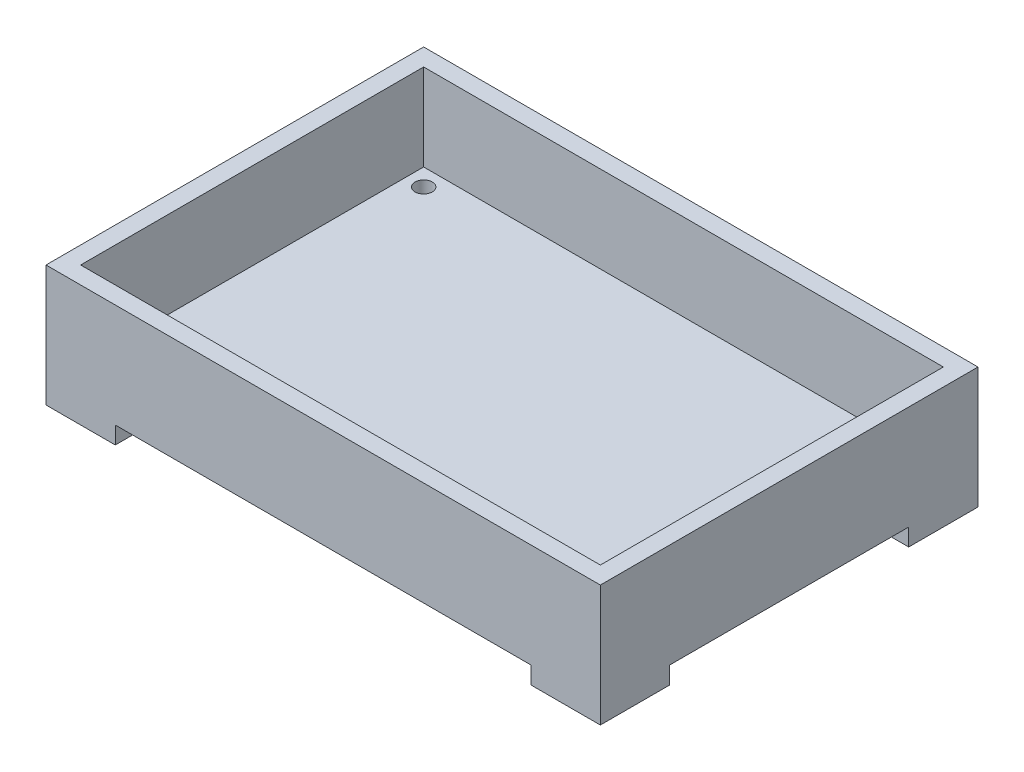
ISO-10303-21;
HEADER;
FILE_DESCRIPTION(('STEP AP214'),'2;1');
FILE_NAME('part.step','',(''),(''),'','','');
FILE_SCHEMA(('AUTOMOTIVE_DESIGN { 1 0 10303 214 1 1 1 1 }'));
ENDSEC;
DATA;
#1=APPLICATION_CONTEXT('core data for automotive mechanical design processes');
#2=APPLICATION_PROTOCOL_DEFINITION('international standard','automotive_design',2000,#1);
#3=PRODUCT_CONTEXT('',#1,'mechanical');
#4=PRODUCT('Part','Part','',(#3));
#5=PRODUCT_RELATED_PRODUCT_CATEGORY('part','',(#4));
#6=PRODUCT_DEFINITION_FORMATION('','',#4);
#7=PRODUCT_DEFINITION_CONTEXT('part definition',#1,'design');
#8=PRODUCT_DEFINITION('design','',#6,#7);
#9=PRODUCT_DEFINITION_SHAPE('','',#8);
#10=(LENGTH_UNIT() NAMED_UNIT(*) SI_UNIT(.MILLI.,.METRE.));
#11=(NAMED_UNIT(*) PLANE_ANGLE_UNIT() SI_UNIT($,.RADIAN.));
#12=(NAMED_UNIT(*) SI_UNIT($,.STERADIAN.) SOLID_ANGLE_UNIT());
#13=UNCERTAINTY_MEASURE_WITH_UNIT(LENGTH_MEASURE(1.E-05),#10,'distance_accuracy_value','');
#14=(GEOMETRIC_REPRESENTATION_CONTEXT(3) GLOBAL_UNCERTAINTY_ASSIGNED_CONTEXT((#13)) GLOBAL_UNIT_ASSIGNED_CONTEXT((#10,
#11,#12)) REPRESENTATION_CONTEXT('',''));
#15=CARTESIAN_POINT('',(0.,0.,0.));
#16=DIRECTION('',(0.,0.,1.));
#17=DIRECTION('',(1.,0.,0.));
#18=AXIS2_PLACEMENT_3D('',#15,#16,#17);
#19=CARTESIAN_POINT('',(0.,0.,0.));
#20=DIRECTION('',(0.,-1.,0.));
#21=DIRECTION('',(0.,0.,-1.));
#22=AXIS2_PLACEMENT_3D('',#19,#20,#21);
#23=PLANE('',#22);
#24=DIRECTION('',(0.,0.,-1.));
#25=VECTOR('',#24,1.);
#26=CARTESIAN_POINT('',(-76.2,0.,-69.215));
#27=LINE('',#26,#25);
#28=CARTESIAN_POINT('',(-76.2,0.,-43.815));
#29=VERTEX_POINT('',#28);
#30=CARTESIAN_POINT('',(-76.2,0.,-69.215));
#31=VERTEX_POINT('',#30);
#32=EDGE_CURVE('E210',#29,#31,#27,.T.);
#33=ORIENTED_EDGE('',*,*,#32,.T.);
#34=DIRECTION('',(-1.,0.,0.));
#35=VECTOR('',#34,1.);
#36=CARTESIAN_POINT('',(-101.6,0.,-69.215));
#37=LINE('',#36,#35);
#38=CARTESIAN_POINT('',(76.2,0.,-69.215));
#39=VERTEX_POINT('',#38);
#40=EDGE_CURVE('E405',#39,#31,#37,.T.);
#41=ORIENTED_EDGE('',*,*,#40,.F.);
#42=DIRECTION('',(0.,0.,-1.));
#43=VECTOR('',#42,1.);
#44=CARTESIAN_POINT('',(76.2,0.,-69.215));
#45=LINE('',#44,#43);
#46=CARTESIAN_POINT('',(76.2,0.,-43.815));
#47=VERTEX_POINT('',#46);
#48=EDGE_CURVE('E238',#47,#39,#45,.T.);
#49=ORIENTED_EDGE('',*,*,#48,.F.);
#50=DIRECTION('',(-1.,0.,0.));
#51=VECTOR('',#50,1.);
#52=CARTESIAN_POINT('',(101.6,0.,-43.815));
#53=LINE('',#52,#51);
#54=CARTESIAN_POINT('',(101.6,0.,-43.815));
#55=VERTEX_POINT('',#54);
#56=EDGE_CURVE('E229',#55,#47,#53,.T.);
#57=ORIENTED_EDGE('',*,*,#56,.F.);
#58=DIRECTION('',(0.,0.,-1.));
#59=VECTOR('',#58,1.);
#60=CARTESIAN_POINT('',(101.6,0.,69.215));
#61=LINE('',#60,#59);
#62=CARTESIAN_POINT('',(101.6,0.,43.815));
#63=VERTEX_POINT('',#62);
#64=EDGE_CURVE('E354',#63,#55,#61,.T.);
#65=ORIENTED_EDGE('',*,*,#64,.F.);
#66=DIRECTION('',(-1.,0.,0.));
#67=VECTOR('',#66,1.);
#68=CARTESIAN_POINT('',(101.6,0.,43.815));
#69=LINE('',#68,#67);
#70=CARTESIAN_POINT('',(76.2,0.,43.815));
#71=VERTEX_POINT('',#70);
#72=EDGE_CURVE('E275',#63,#71,#69,.T.);
#73=ORIENTED_EDGE('',*,*,#72,.T.);
#74=DIRECTION('',(0.,0.,1.));
#75=VECTOR('',#74,1.);
#76=CARTESIAN_POINT('',(76.2,0.,69.215));
#77=LINE('',#76,#75);
#78=CARTESIAN_POINT('',(76.2,0.,69.215));
#79=VERTEX_POINT('',#78);
#80=EDGE_CURVE('E266',#71,#79,#77,.T.);
#81=ORIENTED_EDGE('',*,*,#80,.T.);
#82=DIRECTION('',(1.,0.,0.));
#83=VECTOR('',#82,1.);
#84=CARTESIAN_POINT('',(-101.6,0.,69.215));
#85=LINE('',#84,#83);
#86=CARTESIAN_POINT('',(-76.2,0.,69.215));
#87=VERTEX_POINT('',#86);
#88=EDGE_CURVE('E393',#87,#79,#85,.T.);
#89=ORIENTED_EDGE('',*,*,#88,.F.);
#90=DIRECTION('',(0.,0.,1.));
#91=VECTOR('',#90,1.);
#92=CARTESIAN_POINT('',(-76.2,0.,69.215));
#93=LINE('',#92,#91);
#94=CARTESIAN_POINT('',(-76.2,0.,43.815));
#95=VERTEX_POINT('',#94);
#96=EDGE_CURVE('E317',#95,#87,#93,.T.);
#97=ORIENTED_EDGE('',*,*,#96,.F.);
#98=DIRECTION('',(1.,0.,0.));
#99=VECTOR('',#98,1.);
#100=CARTESIAN_POINT('',(-101.6,0.,43.815));
#101=LINE('',#100,#99);
#102=CARTESIAN_POINT('',(-101.6,0.,43.815));
#103=VERTEX_POINT('',#102);
#104=EDGE_CURVE('E308',#103,#95,#101,.T.);
#105=ORIENTED_EDGE('',*,*,#104,.F.);
#106=DIRECTION('',(0.,0.,1.));
#107=VECTOR('',#106,1.);
#108=CARTESIAN_POINT('',(-101.6,0.,69.215));
#109=LINE('',#108,#107);
#110=CARTESIAN_POINT('',(-101.6,0.,-43.815));
#111=VERTEX_POINT('',#110);
#112=EDGE_CURVE('E408',#111,#103,#109,.T.);
#113=ORIENTED_EDGE('',*,*,#112,.F.);
#114=DIRECTION('',(1.,0.,0.));
#115=VECTOR('',#114,1.);
#116=CARTESIAN_POINT('',(-101.6,0.,-43.815));
#117=LINE('',#116,#115);
#118=EDGE_CURVE('E55',#111,#29,#117,.T.);
#119=ORIENTED_EDGE('',*,*,#118,.T.);
#120=EDGE_LOOP('',(#33,#41,#49,#57,#65,#73,#81,#89,#97,#105,#113,#119));
#121=FACE_BOUND('',#120,.T.);
#122=ADVANCED_FACE('F39',(#121),#23,.T.);
#123=CARTESIAN_POINT('',(0.,38.1,0.));
#124=DIRECTION('',(0.,-1.,0.));
#125=DIRECTION('',(0.,0.,-1.));
#126=AXIS2_PLACEMENT_3D('',#123,#124,#125);
#127=PLANE('',#126);
#128=DIRECTION('',(0.,0.,-1.));
#129=VECTOR('',#128,1.);
#130=CARTESIAN_POINT('',(101.6,38.1,69.215));
#131=LINE('',#130,#129);
#132=CARTESIAN_POINT('',(101.6,38.1,69.215));
#133=VERTEX_POINT('',#132);
#134=CARTESIAN_POINT('',(101.6,38.1,-69.215));
#135=VERTEX_POINT('',#134);
#136=EDGE_CURVE('E388',#133,#135,#131,.T.);
#137=ORIENTED_EDGE('',*,*,#136,.T.);
#138=DIRECTION('',(-1.,0.,0.));
#139=VECTOR('',#138,1.);
#140=CARTESIAN_POINT('',(-101.6,38.1,-69.215));
#141=LINE('',#140,#139);
#142=CARTESIAN_POINT('',(-101.6,38.1,-69.215));
#143=VERTEX_POINT('',#142);
#144=EDGE_CURVE('E392',#135,#143,#141,.T.);
#145=ORIENTED_EDGE('',*,*,#144,.T.);
#146=DIRECTION('',(0.,0.,1.));
#147=VECTOR('',#146,1.);
#148=CARTESIAN_POINT('',(-101.6,38.1,69.215));
#149=LINE('',#148,#147);
#150=CARTESIAN_POINT('',(-101.6,38.1,69.215));
#151=VERTEX_POINT('',#150);
#152=EDGE_CURVE('E184',#143,#151,#149,.T.);
#153=ORIENTED_EDGE('',*,*,#152,.T.);
#154=DIRECTION('',(1.,0.,0.));
#155=VECTOR('',#154,1.);
#156=CARTESIAN_POINT('',(-101.6,38.1,69.215));
#157=LINE('',#156,#155);
#158=EDGE_CURVE('E398',#151,#133,#157,.T.);
#159=ORIENTED_EDGE('',*,*,#158,.T.);
#160=EDGE_LOOP('',(#137,#145,#153,#159));
#161=FACE_BOUND('',#160,.T.);
#162=DIRECTION('',(0.,0.,-1.));
#163=VECTOR('',#162,1.);
#164=CARTESIAN_POINT('',(95.25,38.1,0.));
#165=LINE('',#164,#163);
#166=CARTESIAN_POINT('',(95.25,38.1,62.865));
#167=VERTEX_POINT('',#166);
#168=CARTESIAN_POINT('',(95.25,38.1,-62.865));
#169=VERTEX_POINT('',#168);
#170=EDGE_CURVE('E376',#167,#169,#165,.T.);
#171=ORIENTED_EDGE('',*,*,#170,.F.);
#172=DIRECTION('',(1.,0.,0.));
#173=VECTOR('',#172,1.);
#174=CARTESIAN_POINT('',(0.,38.1,62.865));
#175=LINE('',#174,#173);
#176=CARTESIAN_POINT('',(-95.25,38.1,62.865));
#177=VERTEX_POINT('',#176);
#178=EDGE_CURVE('E361',#177,#167,#175,.T.);
#179=ORIENTED_EDGE('',*,*,#178,.F.);
#180=DIRECTION('',(0.,0.,1.));
#181=VECTOR('',#180,1.);
#182=CARTESIAN_POINT('',(-95.25,38.1,0.));
#183=LINE('',#182,#181);
#184=CARTESIAN_POINT('',(-95.25,38.1,-62.865));
#185=VERTEX_POINT('',#184);
#186=EDGE_CURVE('E382',#185,#177,#183,.T.);
#187=ORIENTED_EDGE('',*,*,#186,.F.);
#188=DIRECTION('',(-1.,0.,0.));
#189=VECTOR('',#188,1.);
#190=CARTESIAN_POINT('',(0.,38.1,-62.865));
#191=LINE('',#190,#189);
#192=EDGE_CURVE('E379',#169,#185,#191,.T.);
#193=ORIENTED_EDGE('',*,*,#192,.F.);
#194=EDGE_LOOP('',(#171,#179,#187,#193));
#195=FACE_BOUND('',#194,.T.);
#196=ADVANCED_FACE('F453',(#161,#195),#127,.F.);
#197=CARTESIAN_POINT('',(101.6,38.1,69.215));
#198=DIRECTION('',(-1.,0.,0.));
#199=DIRECTION('',(0.,0.,1.));
#200=AXIS2_PLACEMENT_3D('',#197,#198,#199);
#201=PLANE('',#200);
#202=DIRECTION('',(0.,-1.,0.));
#203=VECTOR('',#202,1.);
#204=CARTESIAN_POINT('',(101.6,38.1,69.215));
#205=LINE('',#204,#203);
#206=CARTESIAN_POINT('',(101.6,-6.35,69.215));
#207=VERTEX_POINT('',#206);
#208=EDGE_CURVE('E401',#133,#207,#205,.T.);
#209=ORIENTED_EDGE('',*,*,#208,.T.);
#210=DIRECTION('',(0.,0.,-1.));
#211=VECTOR('',#210,1.);
#212=CARTESIAN_POINT('',(101.6,-6.35,69.215));
#213=LINE('',#212,#211);
#214=CARTESIAN_POINT('',(101.6,-6.35,43.815));
#215=VERTEX_POINT('',#214);
#216=EDGE_CURVE('E270',#207,#215,#213,.T.);
#217=ORIENTED_EDGE('',*,*,#216,.T.);
#218=DIRECTION('',(0.,1.,0.));
#219=VECTOR('',#218,1.);
#220=CARTESIAN_POINT('',(101.6,-6.35,43.815));
#221=LINE('',#220,#219);
#222=EDGE_CURVE('E287',#215,#63,#221,.T.);
#223=ORIENTED_EDGE('',*,*,#222,.T.);
#224=ORIENTED_EDGE('',*,*,#64,.T.);
#225=DIRECTION('',(0.,1.,0.));
#226=VECTOR('',#225,1.);
#227=CARTESIAN_POINT('',(101.6,-6.35,-43.815));
#228=LINE('',#227,#226);
#229=CARTESIAN_POINT('',(101.6,-6.35,-43.815));
#230=VERTEX_POINT('',#229);
#231=EDGE_CURVE('E258',#230,#55,#228,.T.);
#232=ORIENTED_EDGE('',*,*,#231,.F.);
#233=DIRECTION('',(0.,0.,1.));
#234=VECTOR('',#233,1.);
#235=CARTESIAN_POINT('',(101.6,-6.35,-69.215));
#236=LINE('',#235,#234);
#237=CARTESIAN_POINT('',(101.6,-6.35,-69.215));
#238=VERTEX_POINT('',#237);
#239=EDGE_CURVE('E233',#238,#230,#236,.T.);
#240=ORIENTED_EDGE('',*,*,#239,.F.);
#241=DIRECTION('',(0.,-1.,0.));
#242=VECTOR('',#241,1.);
#243=CARTESIAN_POINT('',(101.6,38.1,-69.215));
#244=LINE('',#243,#242);
#245=EDGE_CURVE('E11',#135,#238,#244,.T.);
#246=ORIENTED_EDGE('',*,*,#245,.F.);
#247=ORIENTED_EDGE('',*,*,#136,.F.);
#248=EDGE_LOOP('',(#209,#217,#223,#224,#232,#240,#246,#247));
#249=FACE_BOUND('',#248,.T.);
#250=ADVANCED_FACE('F41',(#249),#201,.F.);
#251=CARTESIAN_POINT('',(-101.6,38.1,-69.215));
#252=DIRECTION('',(0.,0.,1.));
#253=DIRECTION('',(1.,0.,0.));
#254=AXIS2_PLACEMENT_3D('',#251,#252,#253);
#255=PLANE('',#254);
#256=ORIENTED_EDGE('',*,*,#245,.T.);
#257=DIRECTION('',(1.,0.,0.));
#258=VECTOR('',#257,1.);
#259=CARTESIAN_POINT('',(101.6,-6.35,-69.215));
#260=LINE('',#259,#258);
#261=CARTESIAN_POINT('',(76.2,-6.35,-69.215));
#262=VERTEX_POINT('',#261);
#263=EDGE_CURVE('E244',#262,#238,#260,.T.);
#264=ORIENTED_EDGE('',*,*,#263,.F.);
#265=DIRECTION('',(0.,1.,0.));
#266=VECTOR('',#265,1.);
#267=CARTESIAN_POINT('',(76.2,-6.35,-69.215));
#268=LINE('',#267,#266);
#269=EDGE_CURVE('E63',#262,#39,#268,.T.);
#270=ORIENTED_EDGE('',*,*,#269,.T.);
#271=ORIENTED_EDGE('',*,*,#40,.T.);
#272=DIRECTION('',(0.,1.,0.));
#273=VECTOR('',#272,1.);
#274=CARTESIAN_POINT('',(-76.2,-6.35,-69.215));
#275=LINE('',#274,#273);
#276=CARTESIAN_POINT('',(-76.2,-6.35,-69.215));
#277=VERTEX_POINT('',#276);
#278=EDGE_CURVE('E199',#277,#31,#275,.T.);
#279=ORIENTED_EDGE('',*,*,#278,.F.);
#280=DIRECTION('',(-1.,0.,0.));
#281=VECTOR('',#280,1.);
#282=CARTESIAN_POINT('',(-101.6,-6.35,-69.215));
#283=LINE('',#282,#281);
#284=CARTESIAN_POINT('',(-101.6,-6.35,-69.215));
#285=VERTEX_POINT('',#284);
#286=EDGE_CURVE('E192',#277,#285,#283,.T.);
#287=ORIENTED_EDGE('',*,*,#286,.T.);
#288=DIRECTION('',(0.,-1.,0.));
#289=VECTOR('',#288,1.);
#290=CARTESIAN_POINT('',(-101.6,38.1,-69.215));
#291=LINE('',#290,#289);
#292=EDGE_CURVE('E48',#143,#285,#291,.T.);
#293=ORIENTED_EDGE('',*,*,#292,.F.);
#294=ORIENTED_EDGE('',*,*,#144,.F.);
#295=EDGE_LOOP('',(#256,#264,#270,#271,#279,#287,#293,#294));
#296=FACE_BOUND('',#295,.T.);
#297=ADVANCED_FACE('F198',(#296),#255,.F.);
#298=CARTESIAN_POINT('',(-101.6,38.1,69.215));
#299=DIRECTION('',(1.,0.,0.));
#300=DIRECTION('',(0.,0.,-1.));
#301=AXIS2_PLACEMENT_3D('',#298,#299,#300);
#302=PLANE('',#301);
#303=ORIENTED_EDGE('',*,*,#292,.T.);
#304=DIRECTION('',(0.,0.,1.));
#305=VECTOR('',#304,1.);
#306=CARTESIAN_POINT('',(-101.6,-6.35,-69.215));
#307=LINE('',#306,#305);
#308=CARTESIAN_POINT('',(-101.6,-6.35,-43.815));
#309=VERTEX_POINT('',#308);
#310=EDGE_CURVE('E181',#285,#309,#307,.T.);
#311=ORIENTED_EDGE('',*,*,#310,.T.);
#312=DIRECTION('',(0.,1.,0.));
#313=VECTOR('',#312,1.);
#314=CARTESIAN_POINT('',(-101.6,-6.35,-43.815));
#315=LINE('',#314,#313);
#316=EDGE_CURVE('E209',#309,#111,#315,.T.);
#317=ORIENTED_EDGE('',*,*,#316,.T.);
#318=ORIENTED_EDGE('',*,*,#112,.T.);
#319=DIRECTION('',(0.,1.,0.));
#320=VECTOR('',#319,1.);
#321=CARTESIAN_POINT('',(-101.6,-6.35,43.815));
#322=LINE('',#321,#320);
#323=CARTESIAN_POINT('',(-101.6,-6.35,43.815));
#324=VERTEX_POINT('',#323);
#325=EDGE_CURVE('E341',#324,#103,#322,.T.);
#326=ORIENTED_EDGE('',*,*,#325,.F.);
#327=DIRECTION('',(0.,0.,-1.));
#328=VECTOR('',#327,1.);
#329=CARTESIAN_POINT('',(-101.6,-6.35,69.215));
#330=LINE('',#329,#328);
#331=CARTESIAN_POINT('',(-101.6,-6.35,69.215));
#332=VERTEX_POINT('',#331);
#333=EDGE_CURVE('E312',#332,#324,#330,.T.);
#334=ORIENTED_EDGE('',*,*,#333,.F.);
#335=DIRECTION('',(0.,-1.,0.));
#336=VECTOR('',#335,1.);
#337=CARTESIAN_POINT('',(-101.6,38.1,69.215));
#338=LINE('',#337,#336);
#339=EDGE_CURVE('E187',#151,#332,#338,.T.);
#340=ORIENTED_EDGE('',*,*,#339,.F.);
#341=ORIENTED_EDGE('',*,*,#152,.F.);
#342=EDGE_LOOP('',(#303,#311,#317,#318,#326,#334,#340,#341));
#343=FACE_BOUND('',#342,.T.);
#344=ADVANCED_FACE('F180',(#343),#302,.F.);
#345=CARTESIAN_POINT('',(-101.6,38.1,69.215));
#346=DIRECTION('',(0.,0.,-1.));
#347=DIRECTION('',(-1.,0.,0.));
#348=AXIS2_PLACEMENT_3D('',#345,#346,#347);
#349=PLANE('',#348);
#350=ORIENTED_EDGE('',*,*,#339,.T.);
#351=DIRECTION('',(-1.,0.,0.));
#352=VECTOR('',#351,1.);
#353=CARTESIAN_POINT('',(-101.6,-6.35,69.215));
#354=LINE('',#353,#352);
#355=CARTESIAN_POINT('',(-76.2,-6.35,69.215));
#356=VERTEX_POINT('',#355);
#357=EDGE_CURVE('E323',#356,#332,#354,.T.);
#358=ORIENTED_EDGE('',*,*,#357,.F.);
#359=DIRECTION('',(0.,1.,0.));
#360=VECTOR('',#359,1.);
#361=CARTESIAN_POINT('',(-76.2,-6.35,69.215));
#362=LINE('',#361,#360);
#363=EDGE_CURVE('E327',#356,#87,#362,.T.);
#364=ORIENTED_EDGE('',*,*,#363,.T.);
#365=ORIENTED_EDGE('',*,*,#88,.T.);
#366=DIRECTION('',(0.,1.,0.));
#367=VECTOR('',#366,1.);
#368=CARTESIAN_POINT('',(76.2,-6.35,69.215));
#369=LINE('',#368,#367);
#370=CARTESIAN_POINT('',(76.2,-6.35,69.215));
#371=VERTEX_POINT('',#370);
#372=EDGE_CURVE('E299',#371,#79,#369,.T.);
#373=ORIENTED_EDGE('',*,*,#372,.F.);
#374=DIRECTION('',(1.,0.,0.));
#375=VECTOR('',#374,1.);
#376=CARTESIAN_POINT('',(101.6,-6.35,69.215));
#377=LINE('',#376,#375);
#378=EDGE_CURVE('E274',#371,#207,#377,.T.);
#379=ORIENTED_EDGE('',*,*,#378,.T.);
#380=ORIENTED_EDGE('',*,*,#208,.F.);
#381=ORIENTED_EDGE('',*,*,#158,.F.);
#382=EDGE_LOOP('',(#350,#358,#364,#365,#373,#379,#380,#381));
#383=FACE_BOUND('',#382,.T.);
#384=ADVANCED_FACE('F420',(#383),#349,.F.);
#385=CARTESIAN_POINT('',(95.25,38.1,69.215));
#386=DIRECTION('',(-1.,0.,0.));
#387=DIRECTION('',(0.,0.,1.));
#388=AXIS2_PLACEMENT_3D('',#385,#386,#387);
#389=PLANE('',#388);
#390=DIRECTION('',(0.,0.,-1.));
#391=VECTOR('',#390,1.);
#392=CARTESIAN_POINT('',(95.25,6.35,0.));
#393=LINE('',#392,#391);
#394=CARTESIAN_POINT('',(95.25,6.35,62.865));
#395=VERTEX_POINT('',#394);
#396=CARTESIAN_POINT('',(95.25,6.35,-62.865));
#397=VERTEX_POINT('',#396);
#398=EDGE_CURVE('E345',#395,#397,#393,.T.);
#399=ORIENTED_EDGE('',*,*,#398,.F.);
#400=DIRECTION('',(0.,-1.,0.));
#401=VECTOR('',#400,1.);
#402=CARTESIAN_POINT('',(95.25,38.1,62.865));
#403=LINE('',#402,#401);
#404=EDGE_CURVE('E356',#167,#395,#403,.T.);
#405=ORIENTED_EDGE('',*,*,#404,.F.);
#406=ORIENTED_EDGE('',*,*,#170,.T.);
#407=DIRECTION('',(0.,-1.,0.));
#408=VECTOR('',#407,1.);
#409=CARTESIAN_POINT('',(95.25,38.1,-62.865));
#410=LINE('',#409,#408);
#411=EDGE_CURVE('E350',#169,#397,#410,.T.);
#412=ORIENTED_EDGE('',*,*,#411,.T.);
#413=EDGE_LOOP('',(#399,#405,#406,#412));
#414=FACE_BOUND('',#413,.T.);
#415=ADVANCED_FACE('F488',(#414),#389,.T.);
#416=CARTESIAN_POINT('',(-101.6,38.1,-62.865));
#417=DIRECTION('',(0.,0.,1.));
#418=DIRECTION('',(1.,0.,0.));
#419=AXIS2_PLACEMENT_3D('',#416,#417,#418);
#420=PLANE('',#419);
#421=DIRECTION('',(-1.,0.,0.));
#422=VECTOR('',#421,1.);
#423=CARTESIAN_POINT('',(0.,6.35,-62.865));
#424=LINE('',#423,#422);
#425=CARTESIAN_POINT('',(-95.25,6.35,-62.865));
#426=VERTEX_POINT('',#425);
#427=EDGE_CURVE('E349',#397,#426,#424,.T.);
#428=ORIENTED_EDGE('',*,*,#427,.F.);
#429=ORIENTED_EDGE('',*,*,#411,.F.);
#430=ORIENTED_EDGE('',*,*,#192,.T.);
#431=DIRECTION('',(0.,-1.,0.));
#432=VECTOR('',#431,1.);
#433=CARTESIAN_POINT('',(-95.25,38.1,-62.865));
#434=LINE('',#433,#432);
#435=EDGE_CURVE('E355',#185,#426,#434,.T.);
#436=ORIENTED_EDGE('',*,*,#435,.T.);
#437=EDGE_LOOP('',(#428,#429,#430,#436));
#438=FACE_BOUND('',#437,.T.);
#439=ADVANCED_FACE('F510',(#438),#420,.T.);
#440=CARTESIAN_POINT('',(-95.25,38.1,69.215));
#441=DIRECTION('',(1.,0.,0.));
#442=DIRECTION('',(0.,0.,-1.));
#443=AXIS2_PLACEMENT_3D('',#440,#441,#442);
#444=PLANE('',#443);
#445=DIRECTION('',(0.,0.,1.));
#446=VECTOR('',#445,1.);
#447=CARTESIAN_POINT('',(-95.25,6.35,0.));
#448=LINE('',#447,#446);
#449=CARTESIAN_POINT('',(-95.25,6.35,62.865));
#450=VERTEX_POINT('',#449);
#451=EDGE_CURVE('E364',#426,#450,#448,.T.);
#452=ORIENTED_EDGE('',*,*,#451,.F.);
#453=ORIENTED_EDGE('',*,*,#435,.F.);
#454=ORIENTED_EDGE('',*,*,#186,.T.);
#455=DIRECTION('',(0.,-1.,0.));
#456=VECTOR('',#455,1.);
#457=CARTESIAN_POINT('',(-95.25,38.1,62.865));
#458=LINE('',#457,#456);
#459=EDGE_CURVE('E360',#177,#450,#458,.T.);
#460=ORIENTED_EDGE('',*,*,#459,.T.);
#461=EDGE_LOOP('',(#452,#453,#454,#460));
#462=FACE_BOUND('',#461,.T.);
#463=ADVANCED_FACE('F520',(#462),#444,.T.);
#464=CARTESIAN_POINT('',(-101.6,38.1,62.865));
#465=DIRECTION('',(0.,0.,-1.));
#466=DIRECTION('',(-1.,0.,0.));
#467=AXIS2_PLACEMENT_3D('',#464,#465,#466);
#468=PLANE('',#467);
#469=DIRECTION('',(1.,0.,0.));
#470=VECTOR('',#469,1.);
#471=CARTESIAN_POINT('',(0.,6.35,62.865));
#472=LINE('',#471,#470);
#473=EDGE_CURVE('E370',#450,#395,#472,.T.);
#474=ORIENTED_EDGE('',*,*,#473,.F.);
#475=ORIENTED_EDGE('',*,*,#459,.F.);
#476=ORIENTED_EDGE('',*,*,#178,.T.);
#477=ORIENTED_EDGE('',*,*,#404,.T.);
#478=EDGE_LOOP('',(#474,#475,#476,#477));
#479=FACE_BOUND('',#478,.T.);
#480=ADVANCED_FACE('F530',(#479),#468,.T.);
#481=CARTESIAN_POINT('',(0.,6.35,0.));
#482=DIRECTION('',(0.,-1.,0.));
#483=DIRECTION('',(0.,0.,-1.));
#484=AXIS2_PLACEMENT_3D('',#481,#482,#483);
#485=PLANE('',#484);
#486=CARTESIAN_POINT('',(-88.9,6.35,-56.515));
#487=DIRECTION('',(0.,-1.,0.));
#488=DIRECTION('',(0.,0.,-1.));
#489=AXIS2_PLACEMENT_3D('',#486,#487,#488);
#490=CIRCLE('',#489,3.175);
#491=CARTESIAN_POINT('',(-88.9,6.35,-59.69));
#492=VERTEX_POINT('',#491);
#493=EDGE_CURVE('E712',#492,#492,#490,.T.);
#494=ORIENTED_EDGE('',*,*,#493,.T.);
#495=EDGE_LOOP('',(#494));
#496=FACE_BOUND('',#495,.T.);
#497=CARTESIAN_POINT('',(88.9,6.35,-56.515));
#498=DIRECTION('',(0.,1.,0.));
#499=DIRECTION('',(0.,0.,-1.));
#500=AXIS2_PLACEMENT_3D('',#497,#498,#499);
#501=CIRCLE('',#500,3.175);
#502=CARTESIAN_POINT('',(88.9,6.35,-59.69));
#503=VERTEX_POINT('',#502);
#504=EDGE_CURVE('E224',#503,#503,#501,.T.);
#505=ORIENTED_EDGE('',*,*,#504,.F.);
#506=EDGE_LOOP('',(#505));
#507=FACE_BOUND('',#506,.T.);
#508=CARTESIAN_POINT('',(88.9,6.35,56.515));
#509=DIRECTION('',(0.,-1.,0.));
#510=DIRECTION('',(0.,0.,1.));
#511=AXIS2_PLACEMENT_3D('',#508,#509,#510);
#512=CIRCLE('',#511,3.175);
#513=CARTESIAN_POINT('',(88.9,6.35,59.69));
#514=VERTEX_POINT('',#513);
#515=EDGE_CURVE('E261',#514,#514,#512,.T.);
#516=ORIENTED_EDGE('',*,*,#515,.T.);
#517=EDGE_LOOP('',(#516));
#518=FACE_BOUND('',#517,.T.);
#519=CARTESIAN_POINT('',(-88.9,6.35,56.515));
#520=DIRECTION('',(0.,1.,0.));
#521=DIRECTION('',(0.,0.,1.));
#522=AXIS2_PLACEMENT_3D('',#519,#520,#521);
#523=CIRCLE('',#522,3.175);
#524=CARTESIAN_POINT('',(-88.9,6.35,59.69));
#525=VERTEX_POINT('',#524);
#526=EDGE_CURVE('E303',#525,#525,#523,.T.);
#527=ORIENTED_EDGE('',*,*,#526,.F.);
#528=EDGE_LOOP('',(#527));
#529=FACE_BOUND('',#528,.T.);
#530=ORIENTED_EDGE('',*,*,#398,.T.);
#531=ORIENTED_EDGE('',*,*,#427,.T.);
#532=ORIENTED_EDGE('',*,*,#451,.T.);
#533=ORIENTED_EDGE('',*,*,#473,.T.);
#534=EDGE_LOOP('',(#530,#531,#532,#533));
#535=FACE_BOUND('',#534,.T.);
#536=ADVANCED_FACE('F540',(#496,#507,#518,#529,#535),#485,.F.);
#537=CARTESIAN_POINT('',(-101.6,-6.35,43.815));
#538=DIRECTION('',(0.,0.,1.));
#539=DIRECTION('',(1.,0.,0.));
#540=AXIS2_PLACEMENT_3D('',#537,#538,#539);
#541=PLANE('',#540);
#542=ORIENTED_EDGE('',*,*,#104,.T.);
#543=DIRECTION('',(0.,1.,0.));
#544=VECTOR('',#543,1.);
#545=CARTESIAN_POINT('',(-76.2,-6.35,43.815));
#546=LINE('',#545,#544);
#547=CARTESIAN_POINT('',(-76.2,-6.35,43.815));
#548=VERTEX_POINT('',#547);
#549=EDGE_CURVE('E337',#548,#95,#546,.T.);
#550=ORIENTED_EDGE('',*,*,#549,.F.);
#551=DIRECTION('',(1.,0.,0.));
#552=VECTOR('',#551,1.);
#553=CARTESIAN_POINT('',(-101.6,-6.35,43.815));
#554=LINE('',#553,#552);
#555=EDGE_CURVE('E316',#324,#548,#554,.T.);
#556=ORIENTED_EDGE('',*,*,#555,.F.);
#557=ORIENTED_EDGE('',*,*,#325,.T.);
#558=EDGE_LOOP('',(#542,#550,#556,#557));
#559=FACE_BOUND('',#558,.T.);
#560=ADVANCED_FACE('F431',(#559),#541,.F.);
#561=CARTESIAN_POINT('',(-76.2,-6.35,69.215));
#562=DIRECTION('',(-1.,0.,0.));
#563=DIRECTION('',(0.,0.,1.));
#564=AXIS2_PLACEMENT_3D('',#561,#562,#563);
#565=PLANE('',#564);
#566=ORIENTED_EDGE('',*,*,#96,.T.);
#567=ORIENTED_EDGE('',*,*,#363,.F.);
#568=DIRECTION('',(0.,0.,1.));
#569=VECTOR('',#568,1.);
#570=CARTESIAN_POINT('',(-76.2,-6.35,69.215));
#571=LINE('',#570,#569);
#572=EDGE_CURVE('E320',#548,#356,#571,.T.);
#573=ORIENTED_EDGE('',*,*,#572,.F.);
#574=ORIENTED_EDGE('',*,*,#549,.T.);
#575=EDGE_LOOP('',(#566,#567,#573,#574));
#576=FACE_BOUND('',#575,.T.);
#577=ADVANCED_FACE('F434',(#576),#565,.F.);
#578=CARTESIAN_POINT('',(0.,-6.35,0.));
#579=DIRECTION('',(0.,-1.,0.));
#580=DIRECTION('',(0.,0.,-1.));
#581=AXIS2_PLACEMENT_3D('',#578,#579,#580);
#582=PLANE('',#581);
#583=CARTESIAN_POINT('',(-88.9,-6.35,56.515));
#584=DIRECTION('',(0.,1.,0.));
#585=DIRECTION('',(0.,0.,1.));
#586=AXIS2_PLACEMENT_3D('',#583,#584,#585);
#587=CIRCLE('',#586,3.175);
#588=CARTESIAN_POINT('',(-88.9,-6.35,59.69));
#589=VERTEX_POINT('',#588);
#590=EDGE_CURVE('E304',#589,#589,#587,.T.);
#591=ORIENTED_EDGE('',*,*,#590,.T.);
#592=EDGE_LOOP('',(#591));
#593=FACE_BOUND('',#592,.T.);
#594=ORIENTED_EDGE('',*,*,#333,.T.);
#595=ORIENTED_EDGE('',*,*,#555,.T.);
#596=ORIENTED_EDGE('',*,*,#572,.T.);
#597=ORIENTED_EDGE('',*,*,#357,.T.);
#598=EDGE_LOOP('',(#594,#595,#596,#597));
#599=FACE_BOUND('',#598,.T.);
#600=ADVANCED_FACE('F424',(#593,#599),#582,.T.);
#601=CARTESIAN_POINT('',(-88.9,-6.35,56.515));
#602=DIRECTION('',(0.,1.,0.));
#603=DIRECTION('',(0.,0.,1.));
#604=AXIS2_PLACEMENT_3D('',#601,#602,#603);
#605=CYLINDRICAL_SURFACE('',#604,3.175);
#606=ORIENTED_EDGE('',*,*,#590,.F.);
#607=EDGE_LOOP('',(#606));
#608=FACE_BOUND('',#607,.T.);
#609=ORIENTED_EDGE('',*,*,#526,.T.);
#610=EDGE_LOOP('',(#609));
#611=FACE_BOUND('',#610,.T.);
#612=ADVANCED_FACE('F569',(#608,#611),#605,.F.);
#613=CARTESIAN_POINT('',(76.2,-6.35,69.215));
#614=DIRECTION('',(-1.,0.,0.));
#615=DIRECTION('',(0.,0.,1.));
#616=AXIS2_PLACEMENT_3D('',#613,#614,#615);
#617=PLANE('',#616);
#618=ORIENTED_EDGE('',*,*,#80,.F.);
#619=DIRECTION('',(0.,1.,0.));
#620=VECTOR('',#619,1.);
#621=CARTESIAN_POINT('',(76.2,-6.35,43.815));
#622=LINE('',#621,#620);
#623=CARTESIAN_POINT('',(76.2,-6.35,43.815));
#624=VERTEX_POINT('',#623);
#625=EDGE_CURVE('E295',#624,#71,#622,.T.);
#626=ORIENTED_EDGE('',*,*,#625,.F.);
#627=DIRECTION('',(0.,0.,1.));
#628=VECTOR('',#627,1.);
#629=CARTESIAN_POINT('',(76.2,-6.35,69.215));
#630=LINE('',#629,#628);
#631=EDGE_CURVE('E279',#624,#371,#630,.T.);
#632=ORIENTED_EDGE('',*,*,#631,.T.);
#633=ORIENTED_EDGE('',*,*,#372,.T.);
#634=EDGE_LOOP('',(#618,#626,#632,#633));
#635=FACE_BOUND('',#634,.T.);
#636=ADVANCED_FACE('F439',(#635),#617,.T.);
#637=CARTESIAN_POINT('',(101.6,-6.35,43.815));
#638=DIRECTION('',(0.,0.,-1.));
#639=DIRECTION('',(-1.,0.,0.));
#640=AXIS2_PLACEMENT_3D('',#637,#638,#639);
#641=PLANE('',#640);
#642=ORIENTED_EDGE('',*,*,#72,.F.);
#643=ORIENTED_EDGE('',*,*,#222,.F.);
#644=DIRECTION('',(-1.,0.,0.));
#645=VECTOR('',#644,1.);
#646=CARTESIAN_POINT('',(101.6,-6.35,43.815));
#647=LINE('',#646,#645);
#648=EDGE_CURVE('E283',#215,#624,#647,.T.);
#649=ORIENTED_EDGE('',*,*,#648,.T.);
#650=ORIENTED_EDGE('',*,*,#625,.T.);
#651=EDGE_LOOP('',(#642,#643,#649,#650));
#652=FACE_BOUND('',#651,.T.);
#653=ADVANCED_FACE('F447',(#652),#641,.T.);
#654=CARTESIAN_POINT('',(0.,-6.35,0.));
#655=DIRECTION('',(0.,-1.,0.));
#656=DIRECTION('',(0.,0.,-1.));
#657=AXIS2_PLACEMENT_3D('',#654,#655,#656);
#658=PLANE('',#657);
#659=CARTESIAN_POINT('',(88.9,-6.35,56.515));
#660=DIRECTION('',(0.,-1.,0.));
#661=DIRECTION('',(0.,0.,1.));
#662=AXIS2_PLACEMENT_3D('',#659,#660,#661);
#663=CIRCLE('',#662,3.175);
#664=CARTESIAN_POINT('',(88.9,-6.35,59.69));
#665=VERTEX_POINT('',#664);
#666=EDGE_CURVE('E262',#665,#665,#663,.T.);
#667=ORIENTED_EDGE('',*,*,#666,.F.);
#668=EDGE_LOOP('',(#667));
#669=FACE_BOUND('',#668,.T.);
#670=ORIENTED_EDGE('',*,*,#216,.F.);
#671=ORIENTED_EDGE('',*,*,#378,.F.);
#672=ORIENTED_EDGE('',*,*,#631,.F.);
#673=ORIENTED_EDGE('',*,*,#648,.F.);
#674=EDGE_LOOP('',(#670,#671,#672,#673));
#675=FACE_BOUND('',#674,.T.);
#676=ADVANCED_FACE('F444',(#669,#675),#658,.T.);
#677=CARTESIAN_POINT('',(88.9,-6.35,56.515));
#678=DIRECTION('',(0.,1.,0.));
#679=DIRECTION('',(0.,0.,1.));
#680=AXIS2_PLACEMENT_3D('',#677,#678,#679);
#681=CYLINDRICAL_SURFACE('',#680,3.175);
#682=ORIENTED_EDGE('',*,*,#666,.T.);
#683=EDGE_LOOP('',(#682));
#684=FACE_BOUND('',#683,.T.);
#685=ORIENTED_EDGE('',*,*,#515,.F.);
#686=EDGE_LOOP('',(#685));
#687=FACE_BOUND('',#686,.T.);
#688=ADVANCED_FACE('F476',(#684,#687),#681,.F.);
#689=CARTESIAN_POINT('',(101.6,-6.35,-43.815));
#690=DIRECTION('',(0.,0.,-1.));
#691=DIRECTION('',(-1.,0.,0.));
#692=AXIS2_PLACEMENT_3D('',#689,#690,#691);
#693=PLANE('',#692);
#694=ORIENTED_EDGE('',*,*,#56,.T.);
#695=DIRECTION('',(0.,1.,0.));
#696=VECTOR('',#695,1.);
#697=CARTESIAN_POINT('',(76.2,-6.35,-43.815));
#698=LINE('',#697,#696);
#699=CARTESIAN_POINT('',(76.2,-6.35,-43.815));
#700=VERTEX_POINT('',#699);
#701=EDGE_CURVE('E254',#700,#47,#698,.T.);
#702=ORIENTED_EDGE('',*,*,#701,.F.);
#703=DIRECTION('',(-1.,0.,0.));
#704=VECTOR('',#703,1.);
#705=CARTESIAN_POINT('',(101.6,-6.35,-43.815));
#706=LINE('',#705,#704);
#707=EDGE_CURVE('E237',#230,#700,#706,.T.);
#708=ORIENTED_EDGE('',*,*,#707,.F.);
#709=ORIENTED_EDGE('',*,*,#231,.T.);
#710=EDGE_LOOP('',(#694,#702,#708,#709));
#711=FACE_BOUND('',#710,.T.);
#712=ADVANCED_FACE('F461',(#711),#693,.F.);
#713=CARTESIAN_POINT('',(76.2,-6.35,-69.215));
#714=DIRECTION('',(1.,0.,0.));
#715=DIRECTION('',(0.,0.,-1.));
#716=AXIS2_PLACEMENT_3D('',#713,#714,#715);
#717=PLANE('',#716);
#718=ORIENTED_EDGE('',*,*,#48,.T.);
#719=ORIENTED_EDGE('',*,*,#269,.F.);
#720=DIRECTION('',(0.,0.,-1.));
#721=VECTOR('',#720,1.);
#722=CARTESIAN_POINT('',(76.2,-6.35,-69.215));
#723=LINE('',#722,#721);
#724=EDGE_CURVE('E241',#700,#262,#723,.T.);
#725=ORIENTED_EDGE('',*,*,#724,.F.);
#726=ORIENTED_EDGE('',*,*,#701,.T.);
#727=EDGE_LOOP('',(#718,#719,#725,#726));
#728=FACE_BOUND('',#727,.T.);
#729=ADVANCED_FACE('F466',(#728),#717,.F.);
#730=CARTESIAN_POINT('',(0.,-6.35,0.));
#731=DIRECTION('',(0.,-1.,0.));
#732=DIRECTION('',(0.,0.,1.));
#733=AXIS2_PLACEMENT_3D('',#730,#731,#732);
#734=PLANE('',#733);
#735=CARTESIAN_POINT('',(88.9,-6.35,-56.515));
#736=DIRECTION('',(0.,1.,0.));
#737=DIRECTION('',(0.,0.,-1.));
#738=AXIS2_PLACEMENT_3D('',#735,#736,#737);
#739=CIRCLE('',#738,3.175);
#740=CARTESIAN_POINT('',(88.9,-6.35,-59.69));
#741=VERTEX_POINT('',#740);
#742=EDGE_CURVE('E225',#741,#741,#739,.T.);
#743=ORIENTED_EDGE('',*,*,#742,.T.);
#744=EDGE_LOOP('',(#743));
#745=FACE_BOUND('',#744,.T.);
#746=ORIENTED_EDGE('',*,*,#239,.T.);
#747=ORIENTED_EDGE('',*,*,#707,.T.);
#748=ORIENTED_EDGE('',*,*,#724,.T.);
#749=ORIENTED_EDGE('',*,*,#263,.T.);
#750=EDGE_LOOP('',(#746,#747,#748,#749));
#751=FACE_BOUND('',#750,.T.);
#752=ADVANCED_FACE('F456',(#745,#751),#734,.T.);
#753=CARTESIAN_POINT('',(88.9,-6.35,-56.515));
#754=DIRECTION('',(0.,1.,0.));
#755=DIRECTION('',(0.,0.,1.));
#756=AXIS2_PLACEMENT_3D('',#753,#754,#755);
#757=CYLINDRICAL_SURFACE('',#756,3.175);
#758=ORIENTED_EDGE('',*,*,#742,.F.);
#759=EDGE_LOOP('',(#758));
#760=FACE_BOUND('',#759,.T.);
#761=ORIENTED_EDGE('',*,*,#504,.T.);
#762=EDGE_LOOP('',(#761));
#763=FACE_BOUND('',#762,.T.);
#764=ADVANCED_FACE('F473',(#760,#763),#757,.F.);
#765=CARTESIAN_POINT('',(-76.2,-6.35,-69.215));
#766=DIRECTION('',(1.,0.,0.));
#767=DIRECTION('',(0.,0.,-1.));
#768=AXIS2_PLACEMENT_3D('',#765,#766,#767);
#769=PLANE('',#768);
#770=ORIENTED_EDGE('',*,*,#32,.F.);
#771=DIRECTION('',(0.,1.,0.));
#772=VECTOR('',#771,1.);
#773=CARTESIAN_POINT('',(-76.2,-6.35,-43.815));
#774=LINE('',#773,#772);
#775=CARTESIAN_POINT('',(-76.2,-6.35,-43.815));
#776=VERTEX_POINT('',#775);
#777=EDGE_CURVE('E219',#776,#29,#774,.T.);
#778=ORIENTED_EDGE('',*,*,#777,.F.);
#779=DIRECTION('',(0.,0.,-1.));
#780=VECTOR('',#779,1.);
#781=CARTESIAN_POINT('',(-76.2,-6.35,-69.215));
#782=LINE('',#781,#780);
#783=EDGE_CURVE('E201',#776,#277,#782,.T.);
#784=ORIENTED_EDGE('',*,*,#783,.T.);
#785=ORIENTED_EDGE('',*,*,#278,.T.);
#786=EDGE_LOOP('',(#770,#778,#784,#785));
#787=FACE_BOUND('',#786,.T.);
#788=ADVANCED_FACE('F665',(#787),#769,.T.);
#789=CARTESIAN_POINT('',(-101.6,-6.35,-43.815));
#790=DIRECTION('',(0.,0.,1.));
#791=DIRECTION('',(1.,0.,0.));
#792=AXIS2_PLACEMENT_3D('',#789,#790,#791);
#793=PLANE('',#792);
#794=ORIENTED_EDGE('',*,*,#118,.F.);
#795=ORIENTED_EDGE('',*,*,#316,.F.);
#796=DIRECTION('',(1.,0.,0.));
#797=VECTOR('',#796,1.);
#798=CARTESIAN_POINT('',(-101.6,-6.35,-43.815));
#799=LINE('',#798,#797);
#800=EDGE_CURVE('E195',#309,#776,#799,.T.);
#801=ORIENTED_EDGE('',*,*,#800,.T.);
#802=ORIENTED_EDGE('',*,*,#777,.T.);
#803=EDGE_LOOP('',(#794,#795,#801,#802));
#804=FACE_BOUND('',#803,.T.);
#805=ADVANCED_FACE('F675',(#804),#793,.T.);
#806=CARTESIAN_POINT('',(0.,-6.35,0.));
#807=DIRECTION('',(0.,-1.,0.));
#808=DIRECTION('',(0.,0.,1.));
#809=AXIS2_PLACEMENT_3D('',#806,#807,#808);
#810=PLANE('',#809);
#811=CARTESIAN_POINT('',(-88.9,-6.35,-56.515));
#812=DIRECTION('',(0.,-1.,0.));
#813=DIRECTION('',(0.,0.,-1.));
#814=AXIS2_PLACEMENT_3D('',#811,#812,#813);
#815=CIRCLE('',#814,3.175);
#816=CARTESIAN_POINT('',(-88.9,-6.35,-59.69));
#817=VERTEX_POINT('',#816);
#818=EDGE_CURVE('E214',#817,#817,#815,.T.);
#819=ORIENTED_EDGE('',*,*,#818,.F.);
#820=EDGE_LOOP('',(#819));
#821=FACE_BOUND('',#820,.T.);
#822=ORIENTED_EDGE('',*,*,#310,.F.);
#823=ORIENTED_EDGE('',*,*,#286,.F.);
#824=ORIENTED_EDGE('',*,*,#783,.F.);
#825=ORIENTED_EDGE('',*,*,#800,.F.);
#826=EDGE_LOOP('',(#822,#823,#824,#825));
#827=FACE_BOUND('',#826,.T.);
#828=ADVANCED_FACE('F190',(#821,#827),#810,.T.);
#829=CARTESIAN_POINT('',(-88.9,-6.35,-56.515));
#830=DIRECTION('',(0.,1.,0.));
#831=DIRECTION('',(0.,0.,1.));
#832=AXIS2_PLACEMENT_3D('',#829,#830,#831);
#833=CYLINDRICAL_SURFACE('',#832,3.175);
#834=ORIENTED_EDGE('',*,*,#818,.T.);
#835=EDGE_LOOP('',(#834));
#836=FACE_BOUND('',#835,.T.);
#837=ORIENTED_EDGE('',*,*,#493,.F.);
#838=EDGE_LOOP('',(#837));
#839=FACE_BOUND('',#838,.T.);
#840=ADVANCED_FACE('F693',(#836,#839),#833,.F.);
#841=CLOSED_SHELL('',(#122,#196,#250,#297,#344,#384,#415,#439,#463,#480,#536,#560,#577,#600,
#612,#636,#653,#676,#688,#712,#729,#752,#764,#788,#805,#828,#840));
#842=MANIFOLD_SOLID_BREP('B2',#841);
#843=ADVANCED_BREP_SHAPE_REPRESENTATION('',(#18,#842),#14);
#844=SHAPE_DEFINITION_REPRESENTATION(#9,#843);
ENDSEC;
END-ISO-10303-21;
